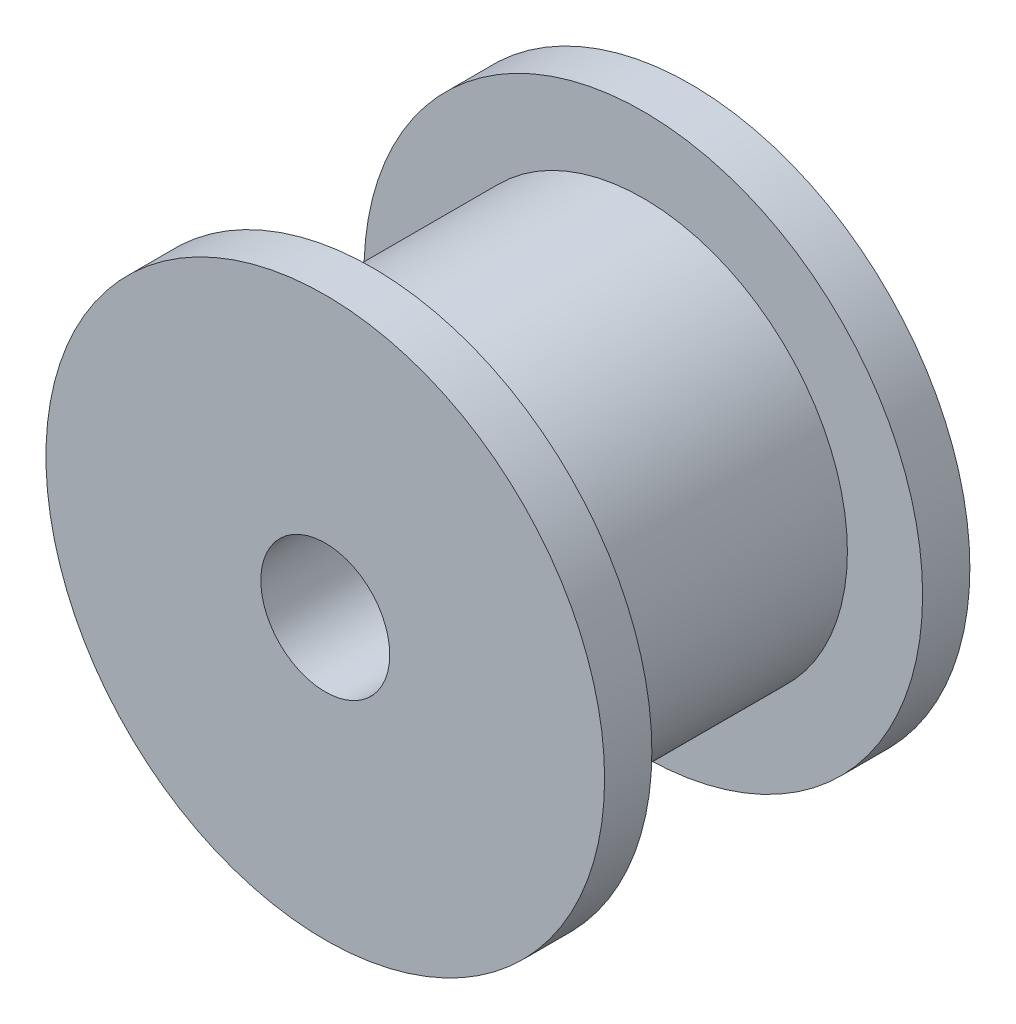
ISO-10303-21;
HEADER;
FILE_DESCRIPTION(('STEP AP214'),'2;1');
FILE_NAME('part.step','',(''),(''),'','','');
FILE_SCHEMA(('AUTOMOTIVE_DESIGN { 1 0 10303 214 1 1 1 1 }'));
ENDSEC;
DATA;
#1=APPLICATION_CONTEXT('core data for automotive mechanical design processes');
#2=APPLICATION_PROTOCOL_DEFINITION('international standard','automotive_design',2000,#1);
#3=PRODUCT_CONTEXT('',#1,'mechanical');
#4=PRODUCT('Part','Part','',(#3));
#5=PRODUCT_RELATED_PRODUCT_CATEGORY('part','',(#4));
#6=PRODUCT_DEFINITION_FORMATION('','',#4);
#7=PRODUCT_DEFINITION_CONTEXT('part definition',#1,'design');
#8=PRODUCT_DEFINITION('design','',#6,#7);
#9=PRODUCT_DEFINITION_SHAPE('','',#8);
#10=(LENGTH_UNIT() NAMED_UNIT(*) SI_UNIT(.MILLI.,.METRE.));
#11=(NAMED_UNIT(*) PLANE_ANGLE_UNIT() SI_UNIT($,.RADIAN.));
#12=(NAMED_UNIT(*) SI_UNIT($,.STERADIAN.) SOLID_ANGLE_UNIT());
#13=UNCERTAINTY_MEASURE_WITH_UNIT(LENGTH_MEASURE(1.E-05),#10,'distance_accuracy_value','');
#14=(GEOMETRIC_REPRESENTATION_CONTEXT(3) GLOBAL_UNCERTAINTY_ASSIGNED_CONTEXT((#13)) GLOBAL_UNIT_ASSIGNED_CONTEXT((#10,
#11,#12)) REPRESENTATION_CONTEXT('',''));
#15=CARTESIAN_POINT('',(0.,0.,0.));
#16=DIRECTION('',(0.,0.,1.));
#17=DIRECTION('',(1.,0.,0.));
#18=AXIS2_PLACEMENT_3D('',#15,#16,#17);
#19=CARTESIAN_POINT('',(0.,0.,8.5));
#20=DIRECTION('',(0.,0.,-1.));
#21=DIRECTION('',(-1.,0.,0.));
#22=AXIS2_PLACEMENT_3D('',#19,#20,#21);
#23=CYLINDRICAL_SURFACE('',#22,6.5);
#24=CARTESIAN_POINT('',(0.,0.,0.));
#25=DIRECTION('',(0.,0.,1.));
#26=DIRECTION('',(1.,0.,0.));
#27=AXIS2_PLACEMENT_3D('',#24,#25,#26);
#28=CIRCLE('',#27,6.5);
#29=CARTESIAN_POINT('',(6.5,0.,0.));
#30=VERTEX_POINT('',#29);
#31=EDGE_CURVE('E41',#30,#30,#28,.T.);
#32=ORIENTED_EDGE('',*,*,#31,.T.);
#33=EDGE_LOOP('',(#32));
#34=FACE_BOUND('',#33,.T.);
#35=CARTESIAN_POINT('',(0.,0.,1.1));
#36=DIRECTION('',(0.,0.,1.));
#37=DIRECTION('',(1.,0.,0.));
#38=AXIS2_PLACEMENT_3D('',#35,#36,#37);
#39=CIRCLE('',#38,6.5);
#40=CARTESIAN_POINT('',(6.5,0.,1.1));
#41=VERTEX_POINT('',#40);
#42=EDGE_CURVE('E37',#41,#41,#39,.T.);
#43=ORIENTED_EDGE('',*,*,#42,.F.);
#44=EDGE_LOOP('',(#43));
#45=FACE_BOUND('',#44,.T.);
#46=ADVANCED_FACE('F33',(#34,#45),#23,.T.);
#47=CARTESIAN_POINT('',(0.,0.,7.4));
#48=DIRECTION('',(0.,0.,1.));
#49=DIRECTION('',(1.,0.,0.));
#50=AXIS2_PLACEMENT_3D('',#47,#48,#49);
#51=CIRCLE('',#50,6.5);
#52=CARTESIAN_POINT('',(6.5,0.,7.4));
#53=VERTEX_POINT('',#52);
#54=EDGE_CURVE('E53',#53,#53,#51,.T.);
#55=ORIENTED_EDGE('',*,*,#54,.T.);
#56=EDGE_LOOP('',(#55));
#57=FACE_BOUND('',#56,.T.);
#58=CARTESIAN_POINT('',(0.,0.,8.5));
#59=DIRECTION('',(0.,0.,1.));
#60=DIRECTION('',(1.,0.,0.));
#61=AXIS2_PLACEMENT_3D('',#58,#59,#60);
#62=CIRCLE('',#61,6.5);
#63=CARTESIAN_POINT('',(6.5,0.,8.5));
#64=VERTEX_POINT('',#63);
#65=EDGE_CURVE('E10',#64,#64,#62,.T.);
#66=ORIENTED_EDGE('',*,*,#65,.F.);
#67=EDGE_LOOP('',(#66));
#68=FACE_BOUND('',#67,.T.);
#69=ADVANCED_FACE('F35',(#57,#68),#23,.T.);
#70=CARTESIAN_POINT('',(0.,0.,8.5));
#71=DIRECTION('',(0.,0.,1.));
#72=DIRECTION('',(1.,0.,0.));
#73=AXIS2_PLACEMENT_3D('',#70,#71,#72);
#74=PLANE('',#73);
#75=CARTESIAN_POINT('',(0.,0.,8.5));
#76=DIRECTION('',(0.,0.,1.));
#77=DIRECTION('',(1.,0.,0.));
#78=AXIS2_PLACEMENT_3D('',#75,#76,#77);
#79=CIRCLE('',#78,1.5);
#80=CARTESIAN_POINT('',(1.5,0.,8.5));
#81=VERTEX_POINT('',#80);
#82=EDGE_CURVE('E49',#81,#81,#79,.T.);
#83=ORIENTED_EDGE('',*,*,#82,.F.);
#84=EDGE_LOOP('',(#83));
#85=FACE_BOUND('',#84,.T.);
#86=ORIENTED_EDGE('',*,*,#65,.T.);
#87=EDGE_LOOP('',(#86));
#88=FACE_BOUND('',#87,.T.);
#89=ADVANCED_FACE('F84',(#85,#88),#74,.T.);
#90=CARTESIAN_POINT('',(0.,0.,0.));
#91=DIRECTION('',(0.,0.,1.));
#92=DIRECTION('',(1.,0.,0.));
#93=AXIS2_PLACEMENT_3D('',#90,#91,#92);
#94=PLANE('',#93);
#95=CARTESIAN_POINT('',(0.,0.,0.));
#96=DIRECTION('',(0.,0.,1.));
#97=DIRECTION('',(1.,0.,0.));
#98=AXIS2_PLACEMENT_3D('',#95,#96,#97);
#99=CIRCLE('',#98,1.5);
#100=CARTESIAN_POINT('',(1.5,0.,0.));
#101=VERTEX_POINT('',#100);
#102=EDGE_CURVE('E46',#101,#101,#99,.T.);
#103=ORIENTED_EDGE('',*,*,#102,.T.);
#104=EDGE_LOOP('',(#103));
#105=FACE_BOUND('',#104,.T.);
#106=ORIENTED_EDGE('',*,*,#31,.F.);
#107=EDGE_LOOP('',(#106));
#108=FACE_BOUND('',#107,.T.);
#109=ADVANCED_FACE('F95',(#105,#108),#94,.F.);
#110=CARTESIAN_POINT('',(0.,0.,-1.5));
#111=DIRECTION('',(0.,0.,1.));
#112=DIRECTION('',(1.,0.,0.));
#113=AXIS2_PLACEMENT_3D('',#110,#111,#112);
#114=CYLINDRICAL_SURFACE('',#113,1.5);
#115=ORIENTED_EDGE('',*,*,#82,.T.);
#116=EDGE_LOOP('',(#115));
#117=FACE_BOUND('',#116,.T.);
#118=ORIENTED_EDGE('',*,*,#102,.F.);
#119=EDGE_LOOP('',(#118));
#120=FACE_BOUND('',#119,.T.);
#121=ADVANCED_FACE('F90',(#117,#120),#114,.F.);
#122=CARTESIAN_POINT('',(0.,0.,1.1));
#123=DIRECTION('',(0.,0.,1.));
#124=DIRECTION('',(1.,0.,0.));
#125=AXIS2_PLACEMENT_3D('',#122,#123,#124);
#126=PLANE('',#125);
#127=CARTESIAN_POINT('',(0.,0.,1.1));
#128=DIRECTION('',(0.,0.,1.));
#129=DIRECTION('',(1.,0.,0.));
#130=AXIS2_PLACEMENT_3D('',#127,#128,#129);
#131=CIRCLE('',#130,4.75);
#132=CARTESIAN_POINT('',(4.75,0.,1.1));
#133=VERTEX_POINT('',#132);
#134=EDGE_CURVE('E55',#133,#133,#131,.T.);
#135=ORIENTED_EDGE('',*,*,#134,.F.);
#136=EDGE_LOOP('',(#135));
#137=FACE_BOUND('',#136,.T.);
#138=ORIENTED_EDGE('',*,*,#42,.T.);
#139=EDGE_LOOP('',(#138));
#140=FACE_BOUND('',#139,.T.);
#141=ADVANCED_FACE('F76',(#137,#140),#126,.T.);
#142=CARTESIAN_POINT('',(0.,0.,7.4));
#143=DIRECTION('',(0.,0.,1.));
#144=DIRECTION('',(1.,0.,0.));
#145=AXIS2_PLACEMENT_3D('',#142,#143,#144);
#146=PLANE('',#145);
#147=CARTESIAN_POINT('',(0.,0.,7.4));
#148=DIRECTION('',(0.,0.,1.));
#149=DIRECTION('',(1.,0.,0.));
#150=AXIS2_PLACEMENT_3D('',#147,#148,#149);
#151=CIRCLE('',#150,4.75);
#152=CARTESIAN_POINT('',(4.75,0.,7.4));
#153=VERTEX_POINT('',#152);
#154=EDGE_CURVE('E60',#153,#153,#151,.T.);
#155=ORIENTED_EDGE('',*,*,#154,.T.);
#156=EDGE_LOOP('',(#155));
#157=FACE_BOUND('',#156,.T.);
#158=ORIENTED_EDGE('',*,*,#54,.F.);
#159=EDGE_LOOP('',(#158));
#160=FACE_BOUND('',#159,.T.);
#161=ADVANCED_FACE('F67',(#157,#160),#146,.F.);
#162=CARTESIAN_POINT('',(0.,0.,1.1));
#163=DIRECTION('',(0.,0.,1.));
#164=DIRECTION('',(1.,0.,0.));
#165=AXIS2_PLACEMENT_3D('',#162,#163,#164);
#166=CYLINDRICAL_SURFACE('',#165,4.75);
#167=ORIENTED_EDGE('',*,*,#134,.T.);
#168=EDGE_LOOP('',(#167));
#169=FACE_BOUND('',#168,.T.);
#170=ORIENTED_EDGE('',*,*,#154,.F.);
#171=EDGE_LOOP('',(#170));
#172=FACE_BOUND('',#171,.T.);
#173=ADVANCED_FACE('F70',(#169,#172),#166,.T.);
#174=CLOSED_SHELL('',(#46,#69,#89,#109,#121,#141,#161,#173));
#175=MANIFOLD_SOLID_BREP('B2',#174);
#176=ADVANCED_BREP_SHAPE_REPRESENTATION('',(#18,#175),#14);
#177=SHAPE_DEFINITION_REPRESENTATION(#9,#176);
ENDSEC;
END-ISO-10303-21;
